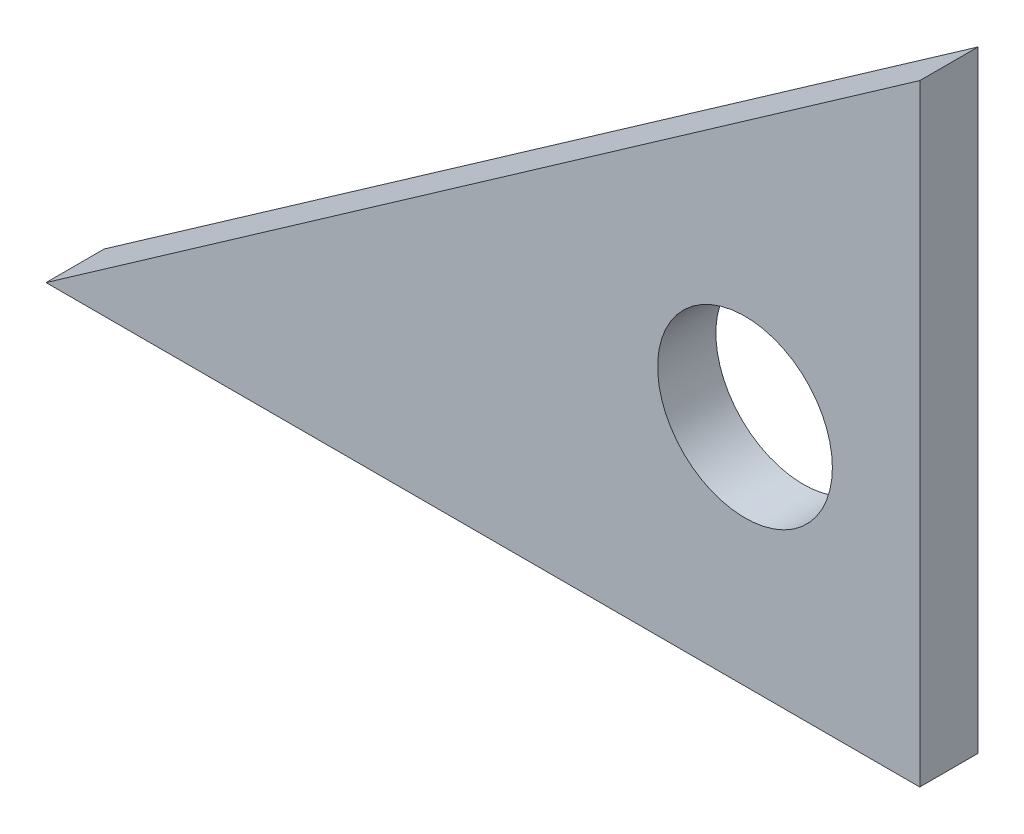
ISO-10303-21;
HEADER;
FILE_DESCRIPTION(('STEP AP214'),'2;1');
FILE_NAME('part.step','',(''),(''),'','','');
FILE_SCHEMA(('AUTOMOTIVE_DESIGN { 1 0 10303 214 1 1 1 1 }'));
ENDSEC;
DATA;
#1=APPLICATION_CONTEXT('core data for automotive mechanical design processes');
#2=APPLICATION_PROTOCOL_DEFINITION('international standard','automotive_design',2000,#1);
#3=PRODUCT_CONTEXT('',#1,'mechanical');
#4=PRODUCT('Part','Part','',(#3));
#5=PRODUCT_RELATED_PRODUCT_CATEGORY('part','',(#4));
#6=PRODUCT_DEFINITION_FORMATION('','',#4);
#7=PRODUCT_DEFINITION_CONTEXT('part definition',#1,'design');
#8=PRODUCT_DEFINITION('design','',#6,#7);
#9=PRODUCT_DEFINITION_SHAPE('','',#8);
#10=(LENGTH_UNIT() NAMED_UNIT(*) SI_UNIT(.MILLI.,.METRE.));
#11=(NAMED_UNIT(*) PLANE_ANGLE_UNIT() SI_UNIT($,.RADIAN.));
#12=(NAMED_UNIT(*) SI_UNIT($,.STERADIAN.) SOLID_ANGLE_UNIT());
#13=UNCERTAINTY_MEASURE_WITH_UNIT(LENGTH_MEASURE(1.E-05),#10,'distance_accuracy_value','');
#14=(GEOMETRIC_REPRESENTATION_CONTEXT(3) GLOBAL_UNCERTAINTY_ASSIGNED_CONTEXT((#13)) GLOBAL_UNIT_ASSIGNED_CONTEXT((#10,
#11,#12)) REPRESENTATION_CONTEXT('',''));
#15=CARTESIAN_POINT('',(0.,0.,0.));
#16=DIRECTION('',(0.,0.,1.));
#17=DIRECTION('',(1.,0.,0.));
#18=AXIS2_PLACEMENT_3D('',#15,#16,#17);
#19=CARTESIAN_POINT('',(95.25,0.,6.35));
#20=DIRECTION('',(0.,-1.,0.));
#21=DIRECTION('',(0.,0.,-1.));
#22=AXIS2_PLACEMENT_3D('',#19,#20,#21);
#23=PLANE('',#22);
#24=DIRECTION('',(-1.,0.,0.));
#25=VECTOR('',#24,1.);
#26=CARTESIAN_POINT('',(95.25,0.,0.));
#27=LINE('',#26,#25);
#28=CARTESIAN_POINT('',(95.25,0.,0.));
#29=VERTEX_POINT('',#28);
#30=CARTESIAN_POINT('',(0.,0.,0.));
#31=VERTEX_POINT('',#30);
#32=EDGE_CURVE('E90',#29,#31,#27,.T.);
#33=ORIENTED_EDGE('',*,*,#32,.F.);
#34=DIRECTION('',(0.,0.,-1.));
#35=VECTOR('',#34,1.);
#36=CARTESIAN_POINT('',(95.25,0.,6.35));
#37=LINE('',#36,#35);
#38=CARTESIAN_POINT('',(95.25,0.,6.35));
#39=VERTEX_POINT('',#38);
#40=EDGE_CURVE('E11',#39,#29,#37,.T.);
#41=ORIENTED_EDGE('',*,*,#40,.F.);
#42=DIRECTION('',(-1.,0.,0.));
#43=VECTOR('',#42,1.);
#44=CARTESIAN_POINT('',(95.25,0.,6.35));
#45=LINE('',#44,#43);
#46=CARTESIAN_POINT('',(0.,0.,6.35));
#47=VERTEX_POINT('',#46);
#48=EDGE_CURVE('E79',#39,#47,#45,.T.);
#49=ORIENTED_EDGE('',*,*,#48,.T.);
#50=DIRECTION('',(0.,0.,-1.));
#51=VECTOR('',#50,1.);
#52=CARTESIAN_POINT('',(0.,0.,6.35));
#53=LINE('',#52,#51);
#54=EDGE_CURVE('E38',#47,#31,#53,.T.);
#55=ORIENTED_EDGE('',*,*,#54,.T.);
#56=EDGE_LOOP('',(#33,#41,#49,#55));
#57=FACE_BOUND('',#56,.T.);
#58=ADVANCED_FACE('F35',(#57),#23,.T.);
#59=CARTESIAN_POINT('',(95.2499999999998,66.6947680144739,6.35));
#60=DIRECTION('',(1.,0.,0.));
#61=DIRECTION('',(0.,1.,0.));
#62=AXIS2_PLACEMENT_3D('',#59,#60,#61);
#63=PLANE('',#62);
#64=DIRECTION('',(0.,-1.,0.));
#65=VECTOR('',#64,1.);
#66=CARTESIAN_POINT('',(95.2499999999998,66.6947680144739,0.));
#67=LINE('',#66,#65);
#68=CARTESIAN_POINT('',(95.2499999999998,66.6947680144739,0.));
#69=VERTEX_POINT('',#68);
#70=EDGE_CURVE('E81',#69,#29,#67,.T.);
#71=ORIENTED_EDGE('',*,*,#70,.F.);
#72=DIRECTION('',(0.,0.,-1.));
#73=VECTOR('',#72,1.);
#74=CARTESIAN_POINT('',(95.2499999999998,66.6947680144739,6.35));
#75=LINE('',#74,#73);
#76=CARTESIAN_POINT('',(95.2499999999998,66.6947680144739,6.35));
#77=VERTEX_POINT('',#76);
#78=EDGE_CURVE('E44',#77,#69,#75,.T.);
#79=ORIENTED_EDGE('',*,*,#78,.F.);
#80=DIRECTION('',(0.,-1.,0.));
#81=VECTOR('',#80,1.);
#82=CARTESIAN_POINT('',(95.2499999999998,66.6947680144739,6.35));
#83=LINE('',#82,#81);
#84=EDGE_CURVE('E76',#77,#39,#83,.T.);
#85=ORIENTED_EDGE('',*,*,#84,.T.);
#86=ORIENTED_EDGE('',*,*,#40,.T.);
#87=EDGE_LOOP('',(#71,#79,#85,#86));
#88=FACE_BOUND('',#87,.T.);
#89=ADVANCED_FACE('F95',(#88),#63,.T.);
#90=CARTESIAN_POINT('',(0.,0.,6.35));
#91=DIRECTION('',(-0.573576436351042,0.819152044288995,0.));
#92=DIRECTION('',(-0.819152044288995,-0.573576436351042,0.));
#93=AXIS2_PLACEMENT_3D('',#90,#91,#92);
#94=PLANE('',#93);
#95=DIRECTION('',(0.819152044288995,0.573576436351042,0.));
#96=VECTOR('',#95,1.);
#97=CARTESIAN_POINT('',(0.,0.,0.));
#98=LINE('',#97,#96);
#99=EDGE_CURVE('E74',#31,#69,#98,.T.);
#100=ORIENTED_EDGE('',*,*,#99,.F.);
#101=ORIENTED_EDGE('',*,*,#54,.F.);
#102=DIRECTION('',(0.819152044288995,0.573576436351042,0.));
#103=VECTOR('',#102,1.);
#104=CARTESIAN_POINT('',(0.,0.,6.35));
#105=LINE('',#104,#103);
#106=EDGE_CURVE('E72',#47,#77,#105,.T.);
#107=ORIENTED_EDGE('',*,*,#106,.T.);
#108=ORIENTED_EDGE('',*,*,#78,.T.);
#109=EDGE_LOOP('',(#100,#101,#107,#108));
#110=FACE_BOUND('',#109,.T.);
#111=ADVANCED_FACE('F71',(#110),#94,.T.);
#112=CARTESIAN_POINT('',(0.,0.,6.35));
#113=DIRECTION('',(0.,0.,1.));
#114=DIRECTION('',(1.,0.,0.));
#115=AXIS2_PLACEMENT_3D('',#112,#113,#114);
#116=PLANE('',#115);
#117=CARTESIAN_POINT('',(76.1999999999997,25.4,6.35));
#118=DIRECTION('',(0.,0.,1.));
#119=DIRECTION('',(1.,0.,0.));
#120=AXIS2_PLACEMENT_3D('',#117,#118,#119);
#121=CIRCLE('',#120,9.52500000000001);
#122=CARTESIAN_POINT('',(85.7249999999998,25.4,6.35));
#123=VERTEX_POINT('',#122);
#124=EDGE_CURVE('E86',#123,#123,#121,.T.);
#125=ORIENTED_EDGE('',*,*,#124,.F.);
#126=EDGE_LOOP('',(#125));
#127=FACE_BOUND('',#126,.T.);
#128=ORIENTED_EDGE('',*,*,#48,.F.);
#129=ORIENTED_EDGE('',*,*,#84,.F.);
#130=ORIENTED_EDGE('',*,*,#106,.F.);
#131=EDGE_LOOP('',(#128,#129,#130));
#132=FACE_BOUND('',#131,.T.);
#133=ADVANCED_FACE('F78',(#127,#132),#116,.T.);
#134=CARTESIAN_POINT('',(0.,0.,0.));
#135=DIRECTION('',(0.,0.,1.));
#136=DIRECTION('',(1.,0.,0.));
#137=AXIS2_PLACEMENT_3D('',#134,#135,#136);
#138=PLANE('',#137);
#139=CARTESIAN_POINT('',(76.1999999999997,25.4,0.));
#140=DIRECTION('',(0.,0.,1.));
#141=DIRECTION('',(1.,0.,0.));
#142=AXIS2_PLACEMENT_3D('',#139,#140,#141);
#143=CIRCLE('',#142,9.52500000000001);
#144=CARTESIAN_POINT('',(85.7249999999998,25.4,0.));
#145=VERTEX_POINT('',#144);
#146=EDGE_CURVE('E92',#145,#145,#143,.T.);
#147=ORIENTED_EDGE('',*,*,#146,.T.);
#148=EDGE_LOOP('',(#147));
#149=FACE_BOUND('',#148,.T.);
#150=ORIENTED_EDGE('',*,*,#32,.T.);
#151=ORIENTED_EDGE('',*,*,#99,.T.);
#152=ORIENTED_EDGE('',*,*,#70,.T.);
#153=EDGE_LOOP('',(#150,#151,#152));
#154=FACE_BOUND('',#153,.T.);
#155=ADVANCED_FACE('F94',(#149,#154),#138,.F.);
#156=CARTESIAN_POINT('',(76.1999999999997,25.4,0.));
#157=DIRECTION('',(0.,0.,1.));
#158=DIRECTION('',(1.,0.,0.));
#159=AXIS2_PLACEMENT_3D('',#156,#157,#158);
#160=CYLINDRICAL_SURFACE('',#159,9.52500000000001);
#161=ORIENTED_EDGE('',*,*,#146,.F.);
#162=EDGE_LOOP('',(#161));
#163=FACE_BOUND('',#162,.T.);
#164=ORIENTED_EDGE('',*,*,#124,.T.);
#165=EDGE_LOOP('',(#164));
#166=FACE_BOUND('',#165,.T.);
#167=ADVANCED_FACE('F105',(#163,#166),#160,.F.);
#168=CLOSED_SHELL('',(#58,#89,#111,#133,#155,#167));
#169=MANIFOLD_SOLID_BREP('B2',#168);
#170=ADVANCED_BREP_SHAPE_REPRESENTATION('',(#18,#169),#14);
#171=SHAPE_DEFINITION_REPRESENTATION(#9,#170);
ENDSEC;
END-ISO-10303-21;
